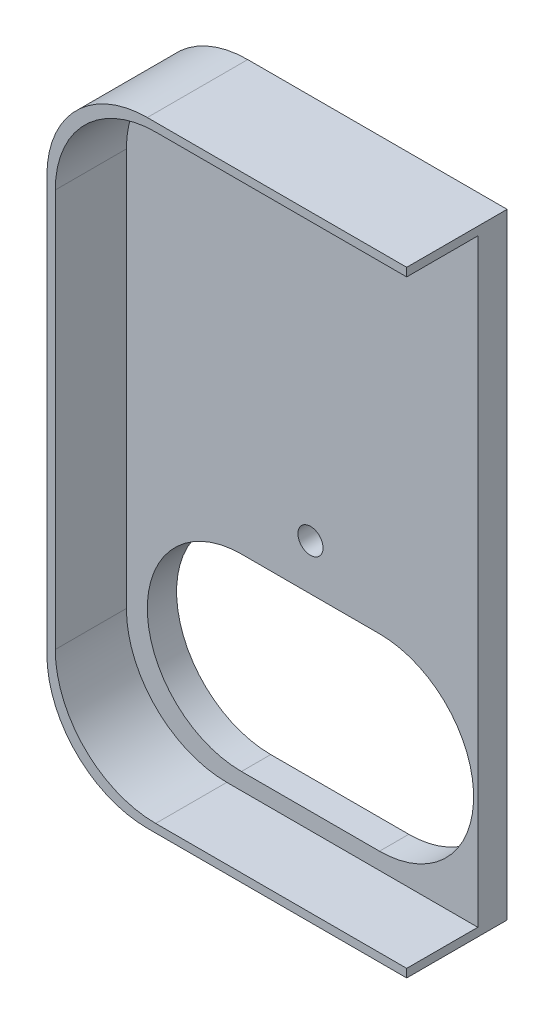
ISO-10303-21;
HEADER;
FILE_DESCRIPTION(('STEP AP214'),'2;1');
FILE_NAME('part.step','',(''),(''),'','','');
FILE_SCHEMA(('AUTOMOTIVE_DESIGN { 1 0 10303 214 1 1 1 1 }'));
ENDSEC;
DATA;
#1=APPLICATION_CONTEXT('core data for automotive mechanical design processes');
#2=APPLICATION_PROTOCOL_DEFINITION('international standard','automotive_design',2000,#1);
#3=PRODUCT_CONTEXT('',#1,'mechanical');
#4=PRODUCT('Part','Part','',(#3));
#5=PRODUCT_RELATED_PRODUCT_CATEGORY('part','',(#4));
#6=PRODUCT_DEFINITION_FORMATION('','',#4);
#7=PRODUCT_DEFINITION_CONTEXT('part definition',#1,'design');
#8=PRODUCT_DEFINITION('design','',#6,#7);
#9=PRODUCT_DEFINITION_SHAPE('','',#8);
#10=(LENGTH_UNIT() NAMED_UNIT(*) SI_UNIT(.MILLI.,.METRE.));
#11=(NAMED_UNIT(*) PLANE_ANGLE_UNIT() SI_UNIT($,.RADIAN.));
#12=(NAMED_UNIT(*) SI_UNIT($,.STERADIAN.) SOLID_ANGLE_UNIT());
#13=UNCERTAINTY_MEASURE_WITH_UNIT(LENGTH_MEASURE(1.E-05),#10,'distance_accuracy_value','');
#14=(GEOMETRIC_REPRESENTATION_CONTEXT(3) GLOBAL_UNCERTAINTY_ASSIGNED_CONTEXT((#13)) GLOBAL_UNIT_ASSIGNED_CONTEXT((#10,
#11,#12)) REPRESENTATION_CONTEXT('',''));
#15=CARTESIAN_POINT('',(0.,0.,0.));
#16=DIRECTION('',(0.,0.,1.));
#17=DIRECTION('',(1.,0.,0.));
#18=AXIS2_PLACEMENT_3D('',#15,#16,#17);
#19=CARTESIAN_POINT('',(-21.5,0.,12.));
#20=DIRECTION('',(-1.,0.,0.));
#21=DIRECTION('',(0.,0.,1.));
#22=AXIS2_PLACEMENT_3D('',#19,#20,#21);
#23=PLANE('',#22);
#24=DIRECTION('',(0.,1.,0.));
#25=VECTOR('',#24,1.);
#26=CARTESIAN_POINT('',(-21.5,0.,0.));
#27=LINE('',#26,#25);
#28=CARTESIAN_POINT('',(-21.5,-24.78,0.));
#29=VERTEX_POINT('',#28);
#30=CARTESIAN_POINT('',(-21.5,24.78,0.));
#31=VERTEX_POINT('',#30);
#32=EDGE_CURVE('E235',#29,#31,#27,.T.);
#33=ORIENTED_EDGE('',*,*,#32,.F.);
#34=DIRECTION('',(0.,0.,-1.));
#35=VECTOR('',#34,1.);
#36=CARTESIAN_POINT('',(-21.5,-24.78,12.));
#37=LINE('',#36,#35);
#38=CARTESIAN_POINT('',(-21.5,-24.78,12.));
#39=VERTEX_POINT('',#38);
#40=EDGE_CURVE('E11',#39,#29,#37,.T.);
#41=ORIENTED_EDGE('',*,*,#40,.F.);
#42=DIRECTION('',(0.,1.,0.));
#43=VECTOR('',#42,1.);
#44=CARTESIAN_POINT('',(-21.5,0.,12.));
#45=LINE('',#44,#43);
#46=CARTESIAN_POINT('',(-21.5,24.78,12.));
#47=VERTEX_POINT('',#46);
#48=EDGE_CURVE('E245',#39,#47,#45,.T.);
#49=ORIENTED_EDGE('',*,*,#48,.T.);
#50=DIRECTION('',(0.,0.,-1.));
#51=VECTOR('',#50,1.);
#52=CARTESIAN_POINT('',(-21.5,24.78,12.));
#53=LINE('',#52,#51);
#54=EDGE_CURVE('E263',#47,#31,#53,.T.);
#55=ORIENTED_EDGE('',*,*,#54,.T.);
#56=EDGE_LOOP('',(#33,#41,#49,#55));
#57=FACE_BOUND('',#56,.T.);
#58=ADVANCED_FACE('F45',(#57),#23,.T.);
#59=CARTESIAN_POINT('',(-9.49999999999999,-24.78,12.));
#60=DIRECTION('',(0.,0.,-1.));
#61=DIRECTION('',(-1.,0.,0.));
#62=AXIS2_PLACEMENT_3D('',#59,#60,#61);
#63=CYLINDRICAL_SURFACE('',#62,12.);
#64=CARTESIAN_POINT('',(-9.49999999999999,-24.78,0.));
#65=DIRECTION('',(0.,0.,1.));
#66=DIRECTION('',(1.,0.,0.));
#67=AXIS2_PLACEMENT_3D('',#64,#65,#66);
#68=CIRCLE('',#67,12.);
#69=CARTESIAN_POINT('',(-9.49999999999999,-36.78,0.));
#70=VERTEX_POINT('',#69);
#71=EDGE_CURVE('E266',#29,#70,#68,.T.);
#72=ORIENTED_EDGE('',*,*,#71,.T.);
#73=DIRECTION('',(0.,0.,-1.));
#74=VECTOR('',#73,1.);
#75=CARTESIAN_POINT('',(-9.49999999999999,-36.78,12.));
#76=LINE('',#75,#74);
#77=CARTESIAN_POINT('',(-9.49999999999999,-36.78,12.));
#78=VERTEX_POINT('',#77);
#79=EDGE_CURVE('E52',#78,#70,#76,.T.);
#80=ORIENTED_EDGE('',*,*,#79,.F.);
#81=CARTESIAN_POINT('',(-9.49999999999999,-24.78,12.));
#82=DIRECTION('',(0.,0.,1.));
#83=DIRECTION('',(1.,0.,0.));
#84=AXIS2_PLACEMENT_3D('',#81,#82,#83);
#85=CIRCLE('',#84,12.);
#86=EDGE_CURVE('E248',#39,#78,#85,.T.);
#87=ORIENTED_EDGE('',*,*,#86,.F.);
#88=ORIENTED_EDGE('',*,*,#40,.T.);
#89=EDGE_LOOP('',(#72,#80,#87,#88));
#90=FACE_BOUND('',#89,.T.);
#91=ADVANCED_FACE('F294',(#90),#63,.T.);
#92=CARTESIAN_POINT('',(0.,-36.78,12.));
#93=DIRECTION('',(0.,-1.,0.));
#94=DIRECTION('',(0.,0.,-1.));
#95=AXIS2_PLACEMENT_3D('',#92,#93,#94);
#96=PLANE('',#95);
#97=DIRECTION('',(-1.,0.,0.));
#98=VECTOR('',#97,1.);
#99=CARTESIAN_POINT('',(0.,-36.78,0.));
#100=LINE('',#99,#98);
#101=CARTESIAN_POINT('',(21.5,-36.78,0.));
#102=VERTEX_POINT('',#101);
#103=EDGE_CURVE('E269',#102,#70,#100,.T.);
#104=ORIENTED_EDGE('',*,*,#103,.F.);
#105=DIRECTION('',(0.,0.,-1.));
#106=VECTOR('',#105,1.);
#107=CARTESIAN_POINT('',(21.5,-36.78,12.));
#108=LINE('',#107,#106);
#109=CARTESIAN_POINT('',(21.5,-36.78,12.));
#110=VERTEX_POINT('',#109);
#111=EDGE_CURVE('E285',#110,#102,#108,.T.);
#112=ORIENTED_EDGE('',*,*,#111,.F.);
#113=DIRECTION('',(-1.,0.,0.));
#114=VECTOR('',#113,1.);
#115=CARTESIAN_POINT('',(0.,-36.78,12.));
#116=LINE('',#115,#114);
#117=EDGE_CURVE('E251',#110,#78,#116,.T.);
#118=ORIENTED_EDGE('',*,*,#117,.T.);
#119=ORIENTED_EDGE('',*,*,#79,.T.);
#120=EDGE_LOOP('',(#104,#112,#118,#119));
#121=FACE_BOUND('',#120,.T.);
#122=ADVANCED_FACE('F289',(#121),#96,.T.);
#123=CARTESIAN_POINT('',(21.5,0.,12.));
#124=DIRECTION('',(-1.,0.,0.));
#125=DIRECTION('',(0.,0.,1.));
#126=AXIS2_PLACEMENT_3D('',#123,#124,#125);
#127=PLANE('',#126);
#128=DIRECTION('',(0.,1.,0.));
#129=VECTOR('',#128,1.);
#130=CARTESIAN_POINT('',(21.5,-35.78,3.5));
#131=LINE('',#130,#129);
#132=CARTESIAN_POINT('',(21.5,-35.78,3.5));
#133=VERTEX_POINT('',#132);
#134=CARTESIAN_POINT('',(21.5,35.78,3.5));
#135=VERTEX_POINT('',#134);
#136=EDGE_CURVE('E200',#133,#135,#131,.T.);
#137=ORIENTED_EDGE('',*,*,#136,.F.);
#138=DIRECTION('',(0.,0.,1.));
#139=VECTOR('',#138,1.);
#140=CARTESIAN_POINT('',(21.5,-35.78,3.5));
#141=LINE('',#140,#139);
#142=CARTESIAN_POINT('',(21.5,-35.78,12.));
#143=VERTEX_POINT('',#142);
#144=EDGE_CURVE('E232',#133,#143,#141,.T.);
#145=ORIENTED_EDGE('',*,*,#144,.T.);
#146=DIRECTION('',(0.,1.,0.));
#147=VECTOR('',#146,1.);
#148=CARTESIAN_POINT('',(21.5,0.,12.));
#149=LINE('',#148,#147);
#150=EDGE_CURVE('E255',#110,#143,#149,.T.);
#151=ORIENTED_EDGE('',*,*,#150,.F.);
#152=ORIENTED_EDGE('',*,*,#111,.T.);
#153=DIRECTION('',(0.,1.,0.));
#154=VECTOR('',#153,1.);
#155=CARTESIAN_POINT('',(21.5,0.,0.));
#156=LINE('',#155,#154);
#157=CARTESIAN_POINT('',(21.5,36.78,0.));
#158=VERTEX_POINT('',#157);
#159=EDGE_CURVE('E272',#102,#158,#156,.T.);
#160=ORIENTED_EDGE('',*,*,#159,.T.);
#161=DIRECTION('',(0.,0.,-1.));
#162=VECTOR('',#161,1.);
#163=CARTESIAN_POINT('',(21.5,36.78,12.));
#164=LINE('',#163,#162);
#165=CARTESIAN_POINT('',(21.5,36.78,12.));
#166=VERTEX_POINT('',#165);
#167=EDGE_CURVE('E282',#166,#158,#164,.T.);
#168=ORIENTED_EDGE('',*,*,#167,.F.);
#169=CARTESIAN_POINT('',(21.5,35.78,12.));
#170=VERTEX_POINT('',#169);
#171=EDGE_CURVE('E254',#170,#166,#149,.T.);
#172=ORIENTED_EDGE('',*,*,#171,.F.);
#173=DIRECTION('',(0.,0.,1.));
#174=VECTOR('',#173,1.);
#175=CARTESIAN_POINT('',(21.5,35.78,3.5));
#176=LINE('',#175,#174);
#177=EDGE_CURVE('E219',#135,#170,#176,.T.);
#178=ORIENTED_EDGE('',*,*,#177,.F.);
#179=EDGE_LOOP('',(#137,#145,#151,#152,#160,#168,#172,#178));
#180=FACE_BOUND('',#179,.T.);
#181=ADVANCED_FACE('F303',(#180),#127,.F.);
#182=CARTESIAN_POINT('',(0.,36.78,12.));
#183=DIRECTION('',(0.,-1.,0.));
#184=DIRECTION('',(0.,0.,-1.));
#185=AXIS2_PLACEMENT_3D('',#182,#183,#184);
#186=PLANE('',#185);
#187=DIRECTION('',(-1.,0.,0.));
#188=VECTOR('',#187,1.);
#189=CARTESIAN_POINT('',(0.,36.78,0.));
#190=LINE('',#189,#188);
#191=CARTESIAN_POINT('',(-9.49999999999999,36.78,0.));
#192=VERTEX_POINT('',#191);
#193=EDGE_CURVE('E274',#158,#192,#190,.T.);
#194=ORIENTED_EDGE('',*,*,#193,.T.);
#195=DIRECTION('',(0.,0.,-1.));
#196=VECTOR('',#195,1.);
#197=CARTESIAN_POINT('',(-9.49999999999999,36.78,12.));
#198=LINE('',#197,#196);
#199=CARTESIAN_POINT('',(-9.49999999999999,36.78,12.));
#200=VERTEX_POINT('',#199);
#201=EDGE_CURVE('E280',#200,#192,#198,.T.);
#202=ORIENTED_EDGE('',*,*,#201,.F.);
#203=DIRECTION('',(-1.,0.,0.));
#204=VECTOR('',#203,1.);
#205=CARTESIAN_POINT('',(0.,36.78,12.));
#206=LINE('',#205,#204);
#207=EDGE_CURVE('E258',#166,#200,#206,.T.);
#208=ORIENTED_EDGE('',*,*,#207,.F.);
#209=ORIENTED_EDGE('',*,*,#167,.T.);
#210=EDGE_LOOP('',(#194,#202,#208,#209));
#211=FACE_BOUND('',#210,.T.);
#212=ADVANCED_FACE('F308',(#211),#186,.F.);
#213=CARTESIAN_POINT('',(-9.49999999999999,24.78,12.));
#214=DIRECTION('',(0.,0.,-1.));
#215=DIRECTION('',(-1.,0.,0.));
#216=AXIS2_PLACEMENT_3D('',#213,#214,#215);
#217=CYLINDRICAL_SURFACE('',#216,12.);
#218=CARTESIAN_POINT('',(-9.49999999999999,24.78,0.));
#219=DIRECTION('',(0.,0.,1.));
#220=DIRECTION('',(1.,0.,0.));
#221=AXIS2_PLACEMENT_3D('',#218,#219,#220);
#222=CIRCLE('',#221,12.);
#223=EDGE_CURVE('E249',#31,#192,#222,.F.);
#224=ORIENTED_EDGE('',*,*,#223,.F.);
#225=ORIENTED_EDGE('',*,*,#54,.F.);
#226=CARTESIAN_POINT('',(-9.49999999999999,24.78,12.));
#227=DIRECTION('',(0.,0.,1.));
#228=DIRECTION('',(1.,0.,0.));
#229=AXIS2_PLACEMENT_3D('',#226,#227,#228);
#230=CIRCLE('',#229,12.);
#231=EDGE_CURVE('E260',#47,#200,#230,.F.);
#232=ORIENTED_EDGE('',*,*,#231,.T.);
#233=ORIENTED_EDGE('',*,*,#201,.T.);
#234=EDGE_LOOP('',(#224,#225,#232,#233));
#235=FACE_BOUND('',#234,.T.);
#236=ADVANCED_FACE('F330',(#235),#217,.T.);
#237=CARTESIAN_POINT('',(0.,0.,12.));
#238=DIRECTION('',(0.,0.,1.));
#239=DIRECTION('',(1.,0.,0.));
#240=AXIS2_PLACEMENT_3D('',#237,#238,#239);
#241=PLANE('',#240);
#242=DIRECTION('',(1.,0.,0.));
#243=VECTOR('',#242,1.);
#244=CARTESIAN_POINT('',(21.5,-35.78,12.));
#245=LINE('',#244,#243);
#246=CARTESIAN_POINT('',(-8.49999999999998,-35.78,12.));
#247=VERTEX_POINT('',#246);
#248=EDGE_CURVE('E204',#247,#143,#245,.T.);
#249=ORIENTED_EDGE('',*,*,#248,.F.);
#250=CARTESIAN_POINT('',(-8.49999999999998,-23.78,12.));
#251=DIRECTION('',(0.,0.,1.));
#252=DIRECTION('',(-1.,0.,0.));
#253=AXIS2_PLACEMENT_3D('',#250,#251,#252);
#254=CIRCLE('',#253,12.);
#255=CARTESIAN_POINT('',(-20.5,-23.78,12.));
#256=VERTEX_POINT('',#255);
#257=EDGE_CURVE('E228',#256,#247,#254,.T.);
#258=ORIENTED_EDGE('',*,*,#257,.F.);
#259=DIRECTION('',(0.,-1.,0.));
#260=VECTOR('',#259,1.);
#261=CARTESIAN_POINT('',(-20.5,-23.78,12.));
#262=LINE('',#261,#260);
#263=CARTESIAN_POINT('',(-20.5,23.78,12.));
#264=VERTEX_POINT('',#263);
#265=EDGE_CURVE('E225',#264,#256,#262,.T.);
#266=ORIENTED_EDGE('',*,*,#265,.F.);
#267=CARTESIAN_POINT('',(-8.49999999999998,23.78,12.));
#268=DIRECTION('',(0.,0.,1.));
#269=DIRECTION('',(1.,0.,0.));
#270=AXIS2_PLACEMENT_3D('',#267,#268,#269);
#271=CIRCLE('',#270,12.);
#272=CARTESIAN_POINT('',(-8.49999999999999,35.78,12.));
#273=VERTEX_POINT('',#272);
#274=EDGE_CURVE('E222',#273,#264,#271,.T.);
#275=ORIENTED_EDGE('',*,*,#274,.F.);
#276=DIRECTION('',(-1.,0.,0.));
#277=VECTOR('',#276,1.);
#278=CARTESIAN_POINT('',(21.5,35.78,12.));
#279=LINE('',#278,#277);
#280=EDGE_CURVE('E199',#170,#273,#279,.T.);
#281=ORIENTED_EDGE('',*,*,#280,.F.);
#282=ORIENTED_EDGE('',*,*,#171,.T.);
#283=ORIENTED_EDGE('',*,*,#207,.T.);
#284=ORIENTED_EDGE('',*,*,#231,.F.);
#285=ORIENTED_EDGE('',*,*,#48,.F.);
#286=ORIENTED_EDGE('',*,*,#86,.T.);
#287=ORIENTED_EDGE('',*,*,#117,.F.);
#288=ORIENTED_EDGE('',*,*,#150,.T.);
#289=EDGE_LOOP('',(#249,#258,#266,#275,#281,#282,#283,#284,#285,#286,#287,#288));
#290=FACE_BOUND('',#289,.T.);
#291=ADVANCED_FACE('F313',(#290),#241,.T.);
#292=CARTESIAN_POINT('',(0.,0.,0.));
#293=DIRECTION('',(0.,0.,1.));
#294=DIRECTION('',(1.,0.,0.));
#295=AXIS2_PLACEMENT_3D('',#292,#293,#294);
#296=PLANE('',#295);
#297=DIRECTION('',(1.,0.,0.));
#298=VECTOR('',#297,1.);
#299=CARTESIAN_POINT('',(0.,-33.78,0.));
#300=LINE('',#299,#298);
#301=CARTESIAN_POINT('',(-6.74999999999999,-33.78,0.));
#302=VERTEX_POINT('',#301);
#303=CARTESIAN_POINT('',(9.75000000000002,-33.78,0.));
#304=VERTEX_POINT('',#303);
#305=EDGE_CURVE('E193',#302,#304,#300,.T.);
#306=ORIENTED_EDGE('',*,*,#305,.T.);
#307=CARTESIAN_POINT('',(9.75000000000002,-22.53,0.));
#308=DIRECTION('',(0.,0.,1.));
#309=DIRECTION('',(1.,0.,0.));
#310=AXIS2_PLACEMENT_3D('',#307,#308,#309);
#311=CIRCLE('',#310,11.25);
#312=CARTESIAN_POINT('',(9.75000000000001,-11.28,0.));
#313=VERTEX_POINT('',#312);
#314=EDGE_CURVE('E196',#304,#313,#311,.T.);
#315=ORIENTED_EDGE('',*,*,#314,.T.);
#316=DIRECTION('',(-1.,0.,0.));
#317=VECTOR('',#316,1.);
#318=CARTESIAN_POINT('',(0.,-11.28,0.));
#319=LINE('',#318,#317);
#320=CARTESIAN_POINT('',(-6.75,-11.28,0.));
#321=VERTEX_POINT('',#320);
#322=EDGE_CURVE('E190',#313,#321,#319,.T.);
#323=ORIENTED_EDGE('',*,*,#322,.T.);
#324=CARTESIAN_POINT('',(-6.74999999999999,-22.53,0.));
#325=DIRECTION('',(0.,0.,1.));
#326=DIRECTION('',(1.,0.,0.));
#327=AXIS2_PLACEMENT_3D('',#324,#325,#326);
#328=CIRCLE('',#327,11.25);
#329=EDGE_CURVE('E162',#321,#302,#328,.T.);
#330=ORIENTED_EDGE('',*,*,#329,.T.);
#331=EDGE_LOOP('',(#306,#315,#323,#330));
#332=FACE_BOUND('',#331,.T.);
#333=CARTESIAN_POINT('',(1.49999999999998,-5.78000000000001,0.));
#334=DIRECTION('',(0.,0.,1.));
#335=DIRECTION('',(1.,0.,0.));
#336=AXIS2_PLACEMENT_3D('',#333,#334,#335);
#337=CIRCLE('',#336,1.5);
#338=CARTESIAN_POINT('',(2.99999999999998,-5.78000000000001,0.));
#339=VERTEX_POINT('',#338);
#340=EDGE_CURVE('E182',#339,#339,#337,.T.);
#341=ORIENTED_EDGE('',*,*,#340,.T.);
#342=EDGE_LOOP('',(#341));
#343=FACE_BOUND('',#342,.T.);
#344=ORIENTED_EDGE('',*,*,#32,.T.);
#345=ORIENTED_EDGE('',*,*,#223,.T.);
#346=ORIENTED_EDGE('',*,*,#193,.F.);
#347=ORIENTED_EDGE('',*,*,#159,.F.);
#348=ORIENTED_EDGE('',*,*,#103,.T.);
#349=ORIENTED_EDGE('',*,*,#71,.F.);
#350=EDGE_LOOP('',(#344,#345,#346,#347,#348,#349));
#351=FACE_BOUND('',#350,.T.);
#352=ADVANCED_FACE('F298',(#332,#343,#351),#296,.F.);
#353=CARTESIAN_POINT('',(21.5,-35.78,3.5));
#354=DIRECTION('',(0.,-1.,0.));
#355=DIRECTION('',(0.,0.,-1.));
#356=AXIS2_PLACEMENT_3D('',#353,#354,#355);
#357=PLANE('',#356);
#358=ORIENTED_EDGE('',*,*,#248,.T.);
#359=ORIENTED_EDGE('',*,*,#144,.F.);
#360=DIRECTION('',(1.,0.,0.));
#361=VECTOR('',#360,1.);
#362=CARTESIAN_POINT('',(21.5,-35.78,3.5));
#363=LINE('',#362,#361);
#364=CARTESIAN_POINT('',(-8.49999999999998,-35.78,3.5));
#365=VERTEX_POINT('',#364);
#366=EDGE_CURVE('E216',#365,#133,#363,.T.);
#367=ORIENTED_EDGE('',*,*,#366,.F.);
#368=DIRECTION('',(0.,0.,1.));
#369=VECTOR('',#368,1.);
#370=CARTESIAN_POINT('',(-8.49999999999998,-35.78,3.5));
#371=LINE('',#370,#369);
#372=EDGE_CURVE('E236',#365,#247,#371,.T.);
#373=ORIENTED_EDGE('',*,*,#372,.T.);
#374=EDGE_LOOP('',(#358,#359,#367,#373));
#375=FACE_BOUND('',#374,.T.);
#376=ADVANCED_FACE('F325',(#375),#357,.F.);
#377=CARTESIAN_POINT('',(-8.49999999999998,-23.78,3.5));
#378=DIRECTION('',(0.,0.,1.));
#379=DIRECTION('',(1.,0.,0.));
#380=AXIS2_PLACEMENT_3D('',#377,#378,#379);
#381=CYLINDRICAL_SURFACE('',#380,12.);
#382=ORIENTED_EDGE('',*,*,#257,.T.);
#383=ORIENTED_EDGE('',*,*,#372,.F.);
#384=CARTESIAN_POINT('',(-8.49999999999998,-23.78,3.5));
#385=DIRECTION('',(0.,0.,1.));
#386=DIRECTION('',(-1.,0.,0.));
#387=AXIS2_PLACEMENT_3D('',#384,#385,#386);
#388=CIRCLE('',#387,12.);
#389=CARTESIAN_POINT('',(-20.5,-23.78,3.5));
#390=VERTEX_POINT('',#389);
#391=EDGE_CURVE('E213',#390,#365,#388,.T.);
#392=ORIENTED_EDGE('',*,*,#391,.F.);
#393=DIRECTION('',(0.,0.,1.));
#394=VECTOR('',#393,1.);
#395=CARTESIAN_POINT('',(-20.5,-23.78,3.5));
#396=LINE('',#395,#394);
#397=EDGE_CURVE('E238',#390,#256,#396,.T.);
#398=ORIENTED_EDGE('',*,*,#397,.T.);
#399=EDGE_LOOP('',(#382,#383,#392,#398));
#400=FACE_BOUND('',#399,.T.);
#401=ADVANCED_FACE('F367',(#400),#381,.F.);
#402=CARTESIAN_POINT('',(-20.5,-23.78,3.5));
#403=DIRECTION('',(-1.,0.,0.));
#404=DIRECTION('',(0.,0.,1.));
#405=AXIS2_PLACEMENT_3D('',#402,#403,#404);
#406=PLANE('',#405);
#407=ORIENTED_EDGE('',*,*,#265,.T.);
#408=ORIENTED_EDGE('',*,*,#397,.F.);
#409=DIRECTION('',(0.,-1.,0.));
#410=VECTOR('',#409,1.);
#411=CARTESIAN_POINT('',(-20.5,-23.78,3.5));
#412=LINE('',#411,#410);
#413=CARTESIAN_POINT('',(-20.5,23.78,3.5));
#414=VERTEX_POINT('',#413);
#415=EDGE_CURVE('E210',#414,#390,#412,.T.);
#416=ORIENTED_EDGE('',*,*,#415,.F.);
#417=DIRECTION('',(0.,0.,1.));
#418=VECTOR('',#417,1.);
#419=CARTESIAN_POINT('',(-20.5,23.78,3.5));
#420=LINE('',#419,#418);
#421=EDGE_CURVE('E240',#414,#264,#420,.T.);
#422=ORIENTED_EDGE('',*,*,#421,.T.);
#423=EDGE_LOOP('',(#407,#408,#416,#422));
#424=FACE_BOUND('',#423,.T.);
#425=ADVANCED_FACE('F375',(#424),#406,.F.);
#426=CARTESIAN_POINT('',(-8.49999999999998,23.78,3.5));
#427=DIRECTION('',(0.,0.,1.));
#428=DIRECTION('',(1.,0.,0.));
#429=AXIS2_PLACEMENT_3D('',#426,#427,#428);
#430=CYLINDRICAL_SURFACE('',#429,12.);
#431=ORIENTED_EDGE('',*,*,#274,.T.);
#432=ORIENTED_EDGE('',*,*,#421,.F.);
#433=CARTESIAN_POINT('',(-8.49999999999998,23.78,3.5));
#434=DIRECTION('',(0.,0.,1.));
#435=DIRECTION('',(1.,0.,0.));
#436=AXIS2_PLACEMENT_3D('',#433,#434,#435);
#437=CIRCLE('',#436,12.);
#438=CARTESIAN_POINT('',(-8.49999999999999,35.78,3.5));
#439=VERTEX_POINT('',#438);
#440=EDGE_CURVE('E207',#439,#414,#437,.T.);
#441=ORIENTED_EDGE('',*,*,#440,.F.);
#442=DIRECTION('',(0.,0.,1.));
#443=VECTOR('',#442,1.);
#444=CARTESIAN_POINT('',(-8.49999999999999,35.78,3.5));
#445=LINE('',#444,#443);
#446=EDGE_CURVE('E242',#439,#273,#445,.T.);
#447=ORIENTED_EDGE('',*,*,#446,.T.);
#448=EDGE_LOOP('',(#431,#432,#441,#447));
#449=FACE_BOUND('',#448,.T.);
#450=ADVANCED_FACE('F384',(#449),#430,.F.);
#451=CARTESIAN_POINT('',(21.5,35.78,3.5));
#452=DIRECTION('',(0.,1.,0.));
#453=DIRECTION('',(0.,0.,1.));
#454=AXIS2_PLACEMENT_3D('',#451,#452,#453);
#455=PLANE('',#454);
#456=ORIENTED_EDGE('',*,*,#280,.T.);
#457=ORIENTED_EDGE('',*,*,#446,.F.);
#458=DIRECTION('',(-1.,0.,0.));
#459=VECTOR('',#458,1.);
#460=CARTESIAN_POINT('',(21.5,35.78,3.5));
#461=LINE('',#460,#459);
#462=EDGE_CURVE('E203',#135,#439,#461,.T.);
#463=ORIENTED_EDGE('',*,*,#462,.F.);
#464=ORIENTED_EDGE('',*,*,#177,.T.);
#465=EDGE_LOOP('',(#456,#457,#463,#464));
#466=FACE_BOUND('',#465,.T.);
#467=ADVANCED_FACE('F319',(#466),#455,.F.);
#468=CARTESIAN_POINT('',(-8.49999999999998,23.78,3.5));
#469=DIRECTION('',(0.,0.,1.));
#470=DIRECTION('',(1.,0.,0.));
#471=AXIS2_PLACEMENT_3D('',#468,#469,#470);
#472=PLANE('',#471);
#473=CARTESIAN_POINT('',(9.75000000000002,-22.53,3.5));
#474=DIRECTION('',(0.,0.,1.));
#475=DIRECTION('',(-1.,0.,0.));
#476=AXIS2_PLACEMENT_3D('',#473,#474,#475);
#477=CIRCLE('',#476,11.25);
#478=CARTESIAN_POINT('',(9.75000000000002,-33.78,3.5));
#479=VERTEX_POINT('',#478);
#480=CARTESIAN_POINT('',(9.75000000000001,-11.28,3.5));
#481=VERTEX_POINT('',#480);
#482=EDGE_CURVE('E67',#479,#481,#477,.T.);
#483=ORIENTED_EDGE('',*,*,#482,.F.);
#484=DIRECTION('',(1.,0.,0.));
#485=VECTOR('',#484,1.);
#486=CARTESIAN_POINT('',(9.75000000000002,-33.78,3.5));
#487=LINE('',#486,#485);
#488=CARTESIAN_POINT('',(-6.74999999999999,-33.78,3.5));
#489=VERTEX_POINT('',#488);
#490=EDGE_CURVE('E175',#489,#479,#487,.T.);
#491=ORIENTED_EDGE('',*,*,#490,.F.);
#492=CARTESIAN_POINT('',(-6.74999999999999,-22.53,3.5));
#493=DIRECTION('',(0.,0.,1.));
#494=DIRECTION('',(-1.,0.,0.));
#495=AXIS2_PLACEMENT_3D('',#492,#493,#494);
#496=CIRCLE('',#495,11.25);
#497=CARTESIAN_POINT('',(-6.75,-11.28,3.5));
#498=VERTEX_POINT('',#497);
#499=EDGE_CURVE('E159',#498,#489,#496,.T.);
#500=ORIENTED_EDGE('',*,*,#499,.F.);
#501=DIRECTION('',(-1.,0.,0.));
#502=VECTOR('',#501,1.);
#503=CARTESIAN_POINT('',(9.75000000000001,-11.28,3.5));
#504=LINE('',#503,#502);
#505=EDGE_CURVE('E168',#481,#498,#504,.T.);
#506=ORIENTED_EDGE('',*,*,#505,.F.);
#507=EDGE_LOOP('',(#483,#491,#500,#506));
#508=FACE_BOUND('',#507,.T.);
#509=CARTESIAN_POINT('',(1.49999999999998,-5.78000000000001,3.5));
#510=DIRECTION('',(0.,0.,1.));
#511=DIRECTION('',(1.,0.,0.));
#512=AXIS2_PLACEMENT_3D('',#509,#510,#511);
#513=CIRCLE('',#512,1.5);
#514=CARTESIAN_POINT('',(2.99999999999998,-5.78000000000001,3.5));
#515=VERTEX_POINT('',#514);
#516=EDGE_CURVE('E185',#515,#515,#513,.T.);
#517=ORIENTED_EDGE('',*,*,#516,.F.);
#518=EDGE_LOOP('',(#517));
#519=FACE_BOUND('',#518,.T.);
#520=ORIENTED_EDGE('',*,*,#136,.T.);
#521=ORIENTED_EDGE('',*,*,#462,.T.);
#522=ORIENTED_EDGE('',*,*,#440,.T.);
#523=ORIENTED_EDGE('',*,*,#415,.T.);
#524=ORIENTED_EDGE('',*,*,#391,.T.);
#525=ORIENTED_EDGE('',*,*,#366,.T.);
#526=EDGE_LOOP('',(#520,#521,#522,#523,#524,#525));
#527=FACE_BOUND('',#526,.T.);
#528=ADVANCED_FACE('F172',(#508,#519,#527),#472,.T.);
#529=CARTESIAN_POINT('',(1.49999999999998,-5.78000000000001,-5.));
#530=DIRECTION('',(0.,0.,1.));
#531=DIRECTION('',(1.,0.,0.));
#532=AXIS2_PLACEMENT_3D('',#529,#530,#531);
#533=CYLINDRICAL_SURFACE('',#532,1.5);
#534=ORIENTED_EDGE('',*,*,#516,.T.);
#535=EDGE_LOOP('',(#534));
#536=FACE_BOUND('',#535,.T.);
#537=ORIENTED_EDGE('',*,*,#340,.F.);
#538=EDGE_LOOP('',(#537));
#539=FACE_BOUND('',#538,.T.);
#540=ADVANCED_FACE('F414',(#536,#539),#533,.F.);
#541=CARTESIAN_POINT('',(9.75000000000002,-22.53,-5.));
#542=DIRECTION('',(0.,0.,1.));
#543=DIRECTION('',(1.,0.,0.));
#544=AXIS2_PLACEMENT_3D('',#541,#542,#543);
#545=CYLINDRICAL_SURFACE('',#544,11.25);
#546=DIRECTION('',(0.,0.,1.));
#547=VECTOR('',#546,1.);
#548=CARTESIAN_POINT('',(9.75000000000002,-33.78,-5.));
#549=LINE('',#548,#547);
#550=EDGE_CURVE('E180',#304,#479,#549,.T.);
#551=ORIENTED_EDGE('',*,*,#550,.T.);
#552=ORIENTED_EDGE('',*,*,#482,.T.);
#553=DIRECTION('',(0.,0.,1.));
#554=VECTOR('',#553,1.);
#555=CARTESIAN_POINT('',(9.75000000000001,-11.28,-5.));
#556=LINE('',#555,#554);
#557=EDGE_CURVE('E165',#313,#481,#556,.T.);
#558=ORIENTED_EDGE('',*,*,#557,.F.);
#559=ORIENTED_EDGE('',*,*,#314,.F.);
#560=EDGE_LOOP('',(#551,#552,#558,#559));
#561=FACE_BOUND('',#560,.T.);
#562=ADVANCED_FACE('F422',(#561),#545,.F.);
#563=CARTESIAN_POINT('',(9.75000000000002,-33.78,-5.));
#564=DIRECTION('',(0.,-1.,0.));
#565=DIRECTION('',(1.,0.,0.));
#566=AXIS2_PLACEMENT_3D('',#563,#564,#565);
#567=PLANE('',#566);
#568=DIRECTION('',(0.,0.,1.));
#569=VECTOR('',#568,1.);
#570=CARTESIAN_POINT('',(-6.74999999999999,-33.78,-5.));
#571=LINE('',#570,#569);
#572=EDGE_CURVE('E164',#302,#489,#571,.T.);
#573=ORIENTED_EDGE('',*,*,#572,.T.);
#574=ORIENTED_EDGE('',*,*,#490,.T.);
#575=ORIENTED_EDGE('',*,*,#550,.F.);
#576=ORIENTED_EDGE('',*,*,#305,.F.);
#577=EDGE_LOOP('',(#573,#574,#575,#576));
#578=FACE_BOUND('',#577,.T.);
#579=ADVANCED_FACE('F431',(#578),#567,.F.);
#580=CARTESIAN_POINT('',(-6.74999999999999,-22.53,-5.));
#581=DIRECTION('',(0.,0.,1.));
#582=DIRECTION('',(1.,0.,0.));
#583=AXIS2_PLACEMENT_3D('',#580,#581,#582);
#584=CYLINDRICAL_SURFACE('',#583,11.25);
#585=DIRECTION('',(0.,0.,1.));
#586=VECTOR('',#585,1.);
#587=CARTESIAN_POINT('',(-6.75,-11.28,-5.));
#588=LINE('',#587,#586);
#589=EDGE_CURVE('E59',#321,#498,#588,.T.);
#590=ORIENTED_EDGE('',*,*,#589,.T.);
#591=ORIENTED_EDGE('',*,*,#499,.T.);
#592=ORIENTED_EDGE('',*,*,#572,.F.);
#593=ORIENTED_EDGE('',*,*,#329,.F.);
#594=EDGE_LOOP('',(#590,#591,#592,#593));
#595=FACE_BOUND('',#594,.T.);
#596=ADVANCED_FACE('F156',(#595),#584,.F.);
#597=CARTESIAN_POINT('',(9.75000000000001,-11.28,-5.));
#598=DIRECTION('',(0.,1.,0.));
#599=DIRECTION('',(-1.,0.,0.));
#600=AXIS2_PLACEMENT_3D('',#597,#598,#599);
#601=PLANE('',#600);
#602=ORIENTED_EDGE('',*,*,#557,.T.);
#603=ORIENTED_EDGE('',*,*,#505,.T.);
#604=ORIENTED_EDGE('',*,*,#589,.F.);
#605=ORIENTED_EDGE('',*,*,#322,.F.);
#606=EDGE_LOOP('',(#602,#603,#604,#605));
#607=FACE_BOUND('',#606,.T.);
#608=ADVANCED_FACE('F169',(#607),#601,.F.);
#609=CLOSED_SHELL('',(#58,#91,#122,#181,#212,#236,#291,#352,#376,#401,#425,#450,#467,#528,#540,
#562,#579,#596,#608));
#610=MANIFOLD_SOLID_BREP('B2',#609);
#611=ADVANCED_BREP_SHAPE_REPRESENTATION('',(#18,#610),#14);
#612=SHAPE_DEFINITION_REPRESENTATION(#9,#611);
ENDSEC;
END-ISO-10303-21;
